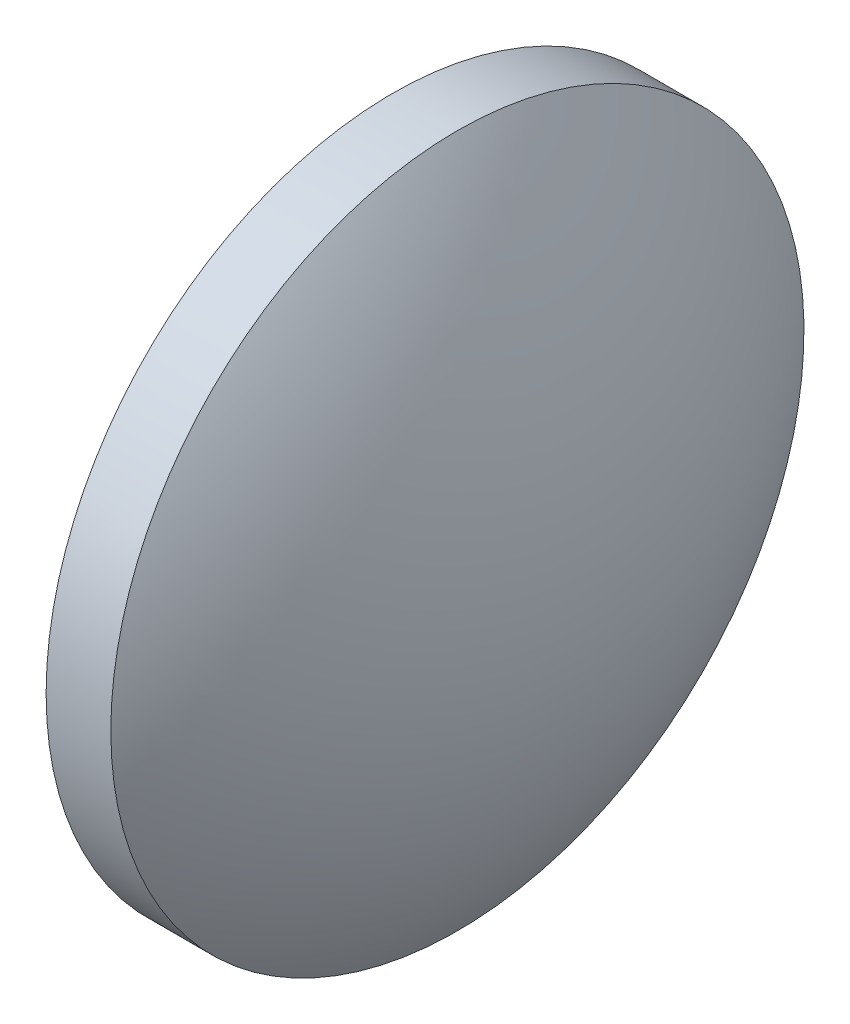
ISO-10303-21;
HEADER;
FILE_DESCRIPTION(('STEP AP214'),'2;1');
FILE_NAME('part.step','',(''),(''),'','','');
FILE_SCHEMA(('AUTOMOTIVE_DESIGN { 1 0 10303 214 1 1 1 1 }'));
ENDSEC;
DATA;
#1=APPLICATION_CONTEXT('core data for automotive mechanical design processes');
#2=APPLICATION_PROTOCOL_DEFINITION('international standard','automotive_design',2000,#1);
#3=PRODUCT_CONTEXT('',#1,'mechanical');
#4=PRODUCT('Part','Part','',(#3));
#5=PRODUCT_RELATED_PRODUCT_CATEGORY('part','',(#4));
#6=PRODUCT_DEFINITION_FORMATION('','',#4);
#7=PRODUCT_DEFINITION_CONTEXT('part definition',#1,'design');
#8=PRODUCT_DEFINITION('design','',#6,#7);
#9=PRODUCT_DEFINITION_SHAPE('','',#8);
#10=(LENGTH_UNIT() NAMED_UNIT(*) SI_UNIT(.MILLI.,.METRE.));
#11=(NAMED_UNIT(*) PLANE_ANGLE_UNIT() SI_UNIT($,.RADIAN.));
#12=(NAMED_UNIT(*) SI_UNIT($,.STERADIAN.) SOLID_ANGLE_UNIT());
#13=UNCERTAINTY_MEASURE_WITH_UNIT(LENGTH_MEASURE(1.E-05),#10,'distance_accuracy_value','');
#14=(GEOMETRIC_REPRESENTATION_CONTEXT(3) GLOBAL_UNCERTAINTY_ASSIGNED_CONTEXT((#13)) GLOBAL_UNIT_ASSIGNED_CONTEXT((#10,
#11,#12)) REPRESENTATION_CONTEXT('',''));
#15=CARTESIAN_POINT('',(0.,0.,0.));
#16=DIRECTION('',(0.,0.,1.));
#17=DIRECTION('',(1.,0.,0.));
#18=AXIS2_PLACEMENT_3D('',#15,#16,#17);
#19=CARTESIAN_POINT('',(338.344647714915,134.701231316413,0.));
#20=DIRECTION('',(-1.,0.,0.));
#21=DIRECTION('',(0.,1.,0.));
#22=AXIS2_PLACEMENT_3D('',#19,#20,#21);
#23=SPHERICAL_SURFACE('',#22,10.5144680851064);
#24=CARTESIAN_POINT('',(346.979115800021,134.701231316413,0.));
#25=DIRECTION('',(-1.,0.,0.));
#26=DIRECTION('',(0.,0.,1.));
#27=AXIS2_PLACEMENT_3D('',#24,#25,#26);
#28=CIRCLE('',#27,6.00000000000001);
#29=CARTESIAN_POINT('',(346.979115800021,134.701231316413,6.00000000000001));
#30=VERTEX_POINT('',#29);
#31=EDGE_CURVE('E10',#30,#30,#28,.T.);
#32=ORIENTED_EDGE('',*,*,#31,.F.);
#33=EDGE_LOOP('',(#32));
#34=FACE_BOUND('',#33,.T.);
#35=ADVANCED_FACE('F35',(#34),#23,.T.);
#36=CARTESIAN_POINT('',(327.38568813999,134.701231316413,0.));
#37=DIRECTION('',(-1.,0.,0.));
#38=DIRECTION('',(0.,0.,1.));
#39=AXIS2_PLACEMENT_3D('',#36,#37,#38);
#40=CYLINDRICAL_SURFACE('',#39,6.00000000000001);
#41=CARTESIAN_POINT('',(345.859115800021,134.701231316413,0.));
#42=DIRECTION('',(-1.,0.,0.));
#43=DIRECTION('',(0.,0.,1.));
#44=AXIS2_PLACEMENT_3D('',#41,#42,#43);
#45=CIRCLE('',#44,6.00000000000001);
#46=CARTESIAN_POINT('',(345.859115800021,134.701231316413,6.00000000000001));
#47=VERTEX_POINT('',#46);
#48=EDGE_CURVE('E41',#47,#47,#45,.T.);
#49=ORIENTED_EDGE('',*,*,#48,.F.);
#50=EDGE_LOOP('',(#49));
#51=FACE_BOUND('',#50,.T.);
#52=ORIENTED_EDGE('',*,*,#31,.T.);
#53=EDGE_LOOP('',(#52));
#54=FACE_BOUND('',#53,.T.);
#55=ADVANCED_FACE('F49',(#51,#54),#40,.T.);
#56=CARTESIAN_POINT('',(345.859115800021,134.701231316413,0.));
#57=DIRECTION('',(1.,0.,0.));
#58=DIRECTION('',(0.,0.,-1.));
#59=AXIS2_PLACEMENT_3D('',#56,#57,#58);
#60=PLANE('',#59);
#61=ORIENTED_EDGE('',*,*,#48,.T.);
#62=EDGE_LOOP('',(#61));
#63=FACE_BOUND('',#62,.T.);
#64=ADVANCED_FACE('F47',(#63),#60,.F.);
#65=CLOSED_SHELL('',(#35,#55,#64));
#66=MANIFOLD_SOLID_BREP('B2',#65);
#67=ADVANCED_BREP_SHAPE_REPRESENTATION('',(#18,#66),#14);
#68=SHAPE_DEFINITION_REPRESENTATION(#9,#67);
ENDSEC;
END-ISO-10303-21;
